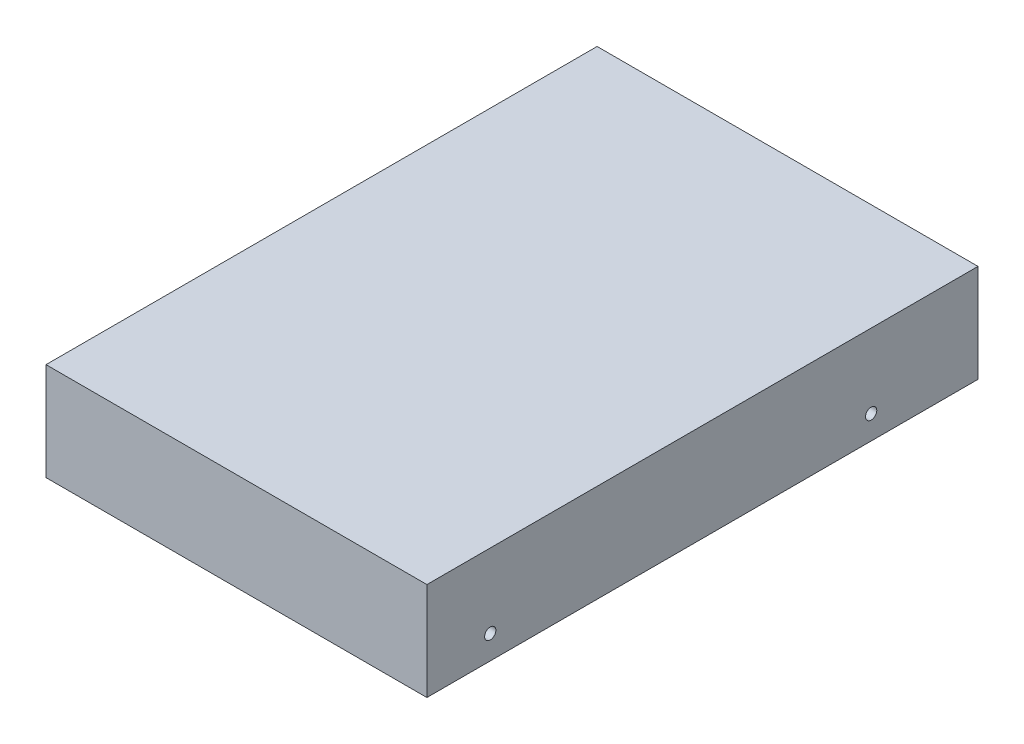
ISO-10303-21;
HEADER;
FILE_DESCRIPTION(('STEP AP214'),'2;1');
FILE_NAME('part.step','',(''),(''),'','','');
FILE_SCHEMA(('AUTOMOTIVE_DESIGN { 1 0 10303 214 1 1 1 1 }'));
ENDSEC;
DATA;
#1=APPLICATION_CONTEXT('core data for automotive mechanical design processes');
#2=APPLICATION_PROTOCOL_DEFINITION('international standard','automotive_design',2000,#1);
#3=PRODUCT_CONTEXT('',#1,'mechanical');
#4=PRODUCT('Part','Part','',(#3));
#5=PRODUCT_RELATED_PRODUCT_CATEGORY('part','',(#4));
#6=PRODUCT_DEFINITION_FORMATION('','',#4);
#7=PRODUCT_DEFINITION_CONTEXT('part definition',#1,'design');
#8=PRODUCT_DEFINITION('design','',#6,#7);
#9=PRODUCT_DEFINITION_SHAPE('','',#8);
#10=(LENGTH_UNIT() NAMED_UNIT(*) SI_UNIT(.MILLI.,.METRE.));
#11=(NAMED_UNIT(*) PLANE_ANGLE_UNIT() SI_UNIT($,.RADIAN.));
#12=(NAMED_UNIT(*) SI_UNIT($,.STERADIAN.) SOLID_ANGLE_UNIT());
#13=UNCERTAINTY_MEASURE_WITH_UNIT(LENGTH_MEASURE(1.E-05),#10,'distance_accuracy_value','');
#14=(GEOMETRIC_REPRESENTATION_CONTEXT(3) GLOBAL_UNCERTAINTY_ASSIGNED_CONTEXT((#13)) GLOBAL_UNIT_ASSIGNED_CONTEXT((#10,
#11,#12)) REPRESENTATION_CONTEXT('',''));
#15=CARTESIAN_POINT('',(0.,0.,0.));
#16=DIRECTION('',(0.,0.,1.));
#17=DIRECTION('',(1.,0.,0.));
#18=AXIS2_PLACEMENT_3D('',#15,#16,#17);
#19=CARTESIAN_POINT('',(0.,26.1,0.));
#20=DIRECTION('',(1.,0.,0.));
#21=DIRECTION('',(0.,0.,-1.));
#22=AXIS2_PLACEMENT_3D('',#19,#20,#21);
#23=PLANE('',#22);
#24=CARTESIAN_POINT('',(0.,6.35,-16.9));
#25=DIRECTION('',(1.,0.,0.));
#26=DIRECTION('',(0.,0.,-1.));
#27=AXIS2_PLACEMENT_3D('',#24,#25,#26);
#28=CIRCLE('',#27,1.7526);
#29=CARTESIAN_POINT('',(0.,6.35,-18.6526));
#30=VERTEX_POINT('',#29);
#31=EDGE_CURVE('E145',#30,#30,#28,.T.);
#32=ORIENTED_EDGE('',*,*,#31,.T.);
#33=EDGE_LOOP('',(#32));
#34=FACE_BOUND('',#33,.T.);
#35=CARTESIAN_POINT('',(0.,6.35,-118.5));
#36=DIRECTION('',(1.,0.,0.));
#37=DIRECTION('',(0.,0.,-1.));
#38=AXIS2_PLACEMENT_3D('',#35,#36,#37);
#39=CIRCLE('',#38,1.75259999999999);
#40=CARTESIAN_POINT('',(0.,6.35,-120.2526));
#41=VERTEX_POINT('',#40);
#42=EDGE_CURVE('E136',#41,#41,#39,.T.);
#43=ORIENTED_EDGE('',*,*,#42,.T.);
#44=EDGE_LOOP('',(#43));
#45=FACE_BOUND('',#44,.T.);
#46=DIRECTION('',(0.,0.,1.));
#47=VECTOR('',#46,1.);
#48=CARTESIAN_POINT('',(0.,0.,0.));
#49=LINE('',#48,#47);
#50=CARTESIAN_POINT('',(0.,0.,-147.));
#51=VERTEX_POINT('',#50);
#52=CARTESIAN_POINT('',(0.,0.,0.));
#53=VERTEX_POINT('',#52);
#54=EDGE_CURVE('E115',#51,#53,#49,.T.);
#55=ORIENTED_EDGE('',*,*,#54,.T.);
#56=DIRECTION('',(0.,-1.,0.));
#57=VECTOR('',#56,1.);
#58=CARTESIAN_POINT('',(0.,26.1,0.));
#59=LINE('',#58,#57);
#60=CARTESIAN_POINT('',(0.,26.1,0.));
#61=VERTEX_POINT('',#60);
#62=EDGE_CURVE('E11',#61,#53,#59,.T.);
#63=ORIENTED_EDGE('',*,*,#62,.F.);
#64=DIRECTION('',(0.,0.,1.));
#65=VECTOR('',#64,1.);
#66=CARTESIAN_POINT('',(0.,26.1,0.));
#67=LINE('',#66,#65);
#68=CARTESIAN_POINT('',(0.,26.1,-147.));
#69=VERTEX_POINT('',#68);
#70=EDGE_CURVE('E99',#69,#61,#67,.T.);
#71=ORIENTED_EDGE('',*,*,#70,.F.);
#72=DIRECTION('',(0.,-1.,0.));
#73=VECTOR('',#72,1.);
#74=CARTESIAN_POINT('',(0.,26.1,-147.));
#75=LINE('',#74,#73);
#76=EDGE_CURVE('E111',#69,#51,#75,.T.);
#77=ORIENTED_EDGE('',*,*,#76,.T.);
#78=EDGE_LOOP('',(#55,#63,#71,#77));
#79=FACE_BOUND('',#78,.T.);
#80=ADVANCED_FACE('F47',(#34,#45,#79),#23,.F.);
#81=CARTESIAN_POINT('',(0.,26.1,0.));
#82=DIRECTION('',(0.,0.,-1.));
#83=DIRECTION('',(-1.,0.,0.));
#84=AXIS2_PLACEMENT_3D('',#81,#82,#83);
#85=PLANE('',#84);
#86=DIRECTION('',(1.,0.,0.));
#87=VECTOR('',#86,1.);
#88=CARTESIAN_POINT('',(0.,0.,0.));
#89=LINE('',#88,#87);
#90=CARTESIAN_POINT('',(101.6,0.,0.));
#91=VERTEX_POINT('',#90);
#92=EDGE_CURVE('E104',#53,#91,#89,.T.);
#93=ORIENTED_EDGE('',*,*,#92,.T.);
#94=DIRECTION('',(0.,-1.,0.));
#95=VECTOR('',#94,1.);
#96=CARTESIAN_POINT('',(101.6,26.1,0.));
#97=LINE('',#96,#95);
#98=CARTESIAN_POINT('',(101.6,26.1,0.));
#99=VERTEX_POINT('',#98);
#100=EDGE_CURVE('E56',#99,#91,#97,.T.);
#101=ORIENTED_EDGE('',*,*,#100,.F.);
#102=DIRECTION('',(1.,0.,0.));
#103=VECTOR('',#102,1.);
#104=CARTESIAN_POINT('',(0.,26.1,0.));
#105=LINE('',#104,#103);
#106=EDGE_CURVE('E94',#61,#99,#105,.T.);
#107=ORIENTED_EDGE('',*,*,#106,.F.);
#108=ORIENTED_EDGE('',*,*,#62,.T.);
#109=EDGE_LOOP('',(#93,#101,#107,#108));
#110=FACE_BOUND('',#109,.T.);
#111=ADVANCED_FACE('F103',(#110),#85,.F.);
#112=CARTESIAN_POINT('',(101.6,26.1,0.));
#113=DIRECTION('',(-1.,0.,0.));
#114=DIRECTION('',(0.,0.,1.));
#115=AXIS2_PLACEMENT_3D('',#112,#113,#114);
#116=PLANE('',#115);
#117=CARTESIAN_POINT('',(101.6,6.35,-118.5));
#118=DIRECTION('',(1.,0.,0.));
#119=DIRECTION('',(0.,0.,-1.));
#120=AXIS2_PLACEMENT_3D('',#117,#118,#119);
#121=CIRCLE('',#120,1.5);
#122=CARTESIAN_POINT('',(101.6,6.35,-120.));
#123=VERTEX_POINT('',#122);
#124=EDGE_CURVE('E160',#123,#123,#121,.T.);
#125=ORIENTED_EDGE('',*,*,#124,.F.);
#126=EDGE_LOOP('',(#125));
#127=FACE_BOUND('',#126,.T.);
#128=CARTESIAN_POINT('',(101.6,6.35,-16.9));
#129=DIRECTION('',(1.,0.,0.));
#130=DIRECTION('',(0.,0.,-1.));
#131=AXIS2_PLACEMENT_3D('',#128,#129,#130);
#132=CIRCLE('',#131,1.5);
#133=CARTESIAN_POINT('',(101.6,6.35,-18.4));
#134=VERTEX_POINT('',#133);
#135=EDGE_CURVE('E156',#134,#134,#132,.T.);
#136=ORIENTED_EDGE('',*,*,#135,.F.);
#137=EDGE_LOOP('',(#136));
#138=FACE_BOUND('',#137,.T.);
#139=DIRECTION('',(0.,0.,-1.));
#140=VECTOR('',#139,1.);
#141=CARTESIAN_POINT('',(101.6,0.,0.));
#142=LINE('',#141,#140);
#143=CARTESIAN_POINT('',(101.6,0.,-147.));
#144=VERTEX_POINT('',#143);
#145=EDGE_CURVE('E81',#91,#144,#142,.T.);
#146=ORIENTED_EDGE('',*,*,#145,.T.);
#147=DIRECTION('',(0.,-1.,0.));
#148=VECTOR('',#147,1.);
#149=CARTESIAN_POINT('',(101.6,26.1,-147.));
#150=LINE('',#149,#148);
#151=CARTESIAN_POINT('',(101.6,26.1,-147.));
#152=VERTEX_POINT('',#151);
#153=EDGE_CURVE('E106',#152,#144,#150,.T.);
#154=ORIENTED_EDGE('',*,*,#153,.F.);
#155=DIRECTION('',(0.,0.,-1.));
#156=VECTOR('',#155,1.);
#157=CARTESIAN_POINT('',(101.6,26.1,0.));
#158=LINE('',#157,#156);
#159=EDGE_CURVE('E97',#99,#152,#158,.T.);
#160=ORIENTED_EDGE('',*,*,#159,.F.);
#161=ORIENTED_EDGE('',*,*,#100,.T.);
#162=EDGE_LOOP('',(#146,#154,#160,#161));
#163=FACE_BOUND('',#162,.T.);
#164=ADVANCED_FACE('F107',(#127,#138,#163),#116,.F.);
#165=CARTESIAN_POINT('',(0.,26.1,-147.));
#166=DIRECTION('',(0.,0.,1.));
#167=DIRECTION('',(1.,0.,0.));
#168=AXIS2_PLACEMENT_3D('',#165,#166,#167);
#169=PLANE('',#168);
#170=DIRECTION('',(-1.,0.,0.));
#171=VECTOR('',#170,1.);
#172=CARTESIAN_POINT('',(0.,0.,-147.));
#173=LINE('',#172,#171);
#174=EDGE_CURVE('E87',#144,#51,#173,.T.);
#175=ORIENTED_EDGE('',*,*,#174,.T.);
#176=ORIENTED_EDGE('',*,*,#76,.F.);
#177=DIRECTION('',(-1.,0.,0.));
#178=VECTOR('',#177,1.);
#179=CARTESIAN_POINT('',(0.,26.1,-147.));
#180=LINE('',#179,#178);
#181=EDGE_CURVE('E64',#152,#69,#180,.T.);
#182=ORIENTED_EDGE('',*,*,#181,.F.);
#183=ORIENTED_EDGE('',*,*,#153,.T.);
#184=EDGE_LOOP('',(#175,#176,#182,#183));
#185=FACE_BOUND('',#184,.T.);
#186=ADVANCED_FACE('F129',(#185),#169,.F.);
#187=CARTESIAN_POINT('',(0.,26.1,0.));
#188=DIRECTION('',(0.,-1.,0.));
#189=DIRECTION('',(0.,0.,-1.));
#190=AXIS2_PLACEMENT_3D('',#187,#188,#189);
#191=PLANE('',#190);
#192=ORIENTED_EDGE('',*,*,#70,.T.);
#193=ORIENTED_EDGE('',*,*,#106,.T.);
#194=ORIENTED_EDGE('',*,*,#159,.T.);
#195=ORIENTED_EDGE('',*,*,#181,.T.);
#196=EDGE_LOOP('',(#192,#193,#194,#195));
#197=FACE_BOUND('',#196,.T.);
#198=ADVANCED_FACE('F95',(#197),#191,.F.);
#199=CARTESIAN_POINT('',(0.,0.,0.));
#200=DIRECTION('',(0.,-1.,0.));
#201=DIRECTION('',(0.,0.,-1.));
#202=AXIS2_PLACEMENT_3D('',#199,#200,#201);
#203=PLANE('',#202);
#204=ORIENTED_EDGE('',*,*,#54,.F.);
#205=ORIENTED_EDGE('',*,*,#174,.F.);
#206=ORIENTED_EDGE('',*,*,#145,.F.);
#207=ORIENTED_EDGE('',*,*,#92,.F.);
#208=EDGE_LOOP('',(#204,#205,#206,#207));
#209=FACE_BOUND('',#208,.T.);
#210=ADVANCED_FACE('F132',(#209),#203,.T.);
#211=CARTESIAN_POINT('',(3.,6.35,-118.5));
#212=DIRECTION('',(-1.,0.,0.));
#213=DIRECTION('',(0.,0.,1.));
#214=AXIS2_PLACEMENT_3D('',#211,#212,#213);
#215=CYLINDRICAL_SURFACE('',#214,1.75259999999999);
#216=CARTESIAN_POINT('',(3.,6.35,-118.5));
#217=DIRECTION('',(1.,0.,0.));
#218=DIRECTION('',(0.,0.,-1.));
#219=AXIS2_PLACEMENT_3D('',#216,#217,#218);
#220=CIRCLE('',#219,1.75259999999999);
#221=CARTESIAN_POINT('',(3.,6.35,-120.2526));
#222=VERTEX_POINT('',#221);
#223=EDGE_CURVE('E140',#222,#222,#220,.T.);
#224=ORIENTED_EDGE('',*,*,#223,.T.);
#225=EDGE_LOOP('',(#224));
#226=FACE_BOUND('',#225,.T.);
#227=ORIENTED_EDGE('',*,*,#42,.F.);
#228=EDGE_LOOP('',(#227));
#229=FACE_BOUND('',#228,.T.);
#230=ADVANCED_FACE('F208',(#226,#229),#215,.F.);
#231=CARTESIAN_POINT('',(3.,6.35,-118.5));
#232=DIRECTION('',(1.,0.,0.));
#233=DIRECTION('',(0.,0.,-1.));
#234=AXIS2_PLACEMENT_3D('',#231,#232,#233);
#235=PLANE('',#234);
#236=ORIENTED_EDGE('',*,*,#223,.F.);
#237=EDGE_LOOP('',(#236));
#238=FACE_BOUND('',#237,.T.);
#239=ADVANCED_FACE('F209',(#238),#235,.F.);
#240=CARTESIAN_POINT('',(3.,6.35,-16.9));
#241=DIRECTION('',(-1.,0.,0.));
#242=DIRECTION('',(0.,0.,1.));
#243=AXIS2_PLACEMENT_3D('',#240,#241,#242);
#244=CYLINDRICAL_SURFACE('',#243,1.7526);
#245=CARTESIAN_POINT('',(3.,6.35,-16.9));
#246=DIRECTION('',(1.,0.,0.));
#247=DIRECTION('',(0.,0.,-1.));
#248=AXIS2_PLACEMENT_3D('',#245,#246,#247);
#249=CIRCLE('',#248,1.7526);
#250=CARTESIAN_POINT('',(3.,6.35,-18.6526));
#251=VERTEX_POINT('',#250);
#252=EDGE_CURVE('E119',#251,#251,#249,.T.);
#253=ORIENTED_EDGE('',*,*,#252,.T.);
#254=EDGE_LOOP('',(#253));
#255=FACE_BOUND('',#254,.T.);
#256=ORIENTED_EDGE('',*,*,#31,.F.);
#257=EDGE_LOOP('',(#256));
#258=FACE_BOUND('',#257,.T.);
#259=ADVANCED_FACE('F193',(#255,#258),#244,.F.);
#260=CARTESIAN_POINT('',(3.,6.35,-16.9));
#261=DIRECTION('',(1.,0.,0.));
#262=DIRECTION('',(0.,0.,-1.));
#263=AXIS2_PLACEMENT_3D('',#260,#261,#262);
#264=PLANE('',#263);
#265=ORIENTED_EDGE('',*,*,#252,.F.);
#266=EDGE_LOOP('',(#265));
#267=FACE_BOUND('',#266,.T.);
#268=ADVANCED_FACE('F184',(#267),#264,.F.);
#269=CARTESIAN_POINT('',(98.6,6.35,-16.9));
#270=DIRECTION('',(1.,0.,0.));
#271=DIRECTION('',(0.,0.,-1.));
#272=AXIS2_PLACEMENT_3D('',#269,#270,#271);
#273=CYLINDRICAL_SURFACE('',#272,1.5);
#274=CARTESIAN_POINT('',(98.6,6.35,-16.9));
#275=DIRECTION('',(1.,0.,0.));
#276=DIRECTION('',(0.,0.,-1.));
#277=AXIS2_PLACEMENT_3D('',#274,#275,#276);
#278=CIRCLE('',#277,1.5);
#279=CARTESIAN_POINT('',(98.6,6.35,-18.4));
#280=VERTEX_POINT('',#279);
#281=EDGE_CURVE('E152',#280,#280,#278,.T.);
#282=ORIENTED_EDGE('',*,*,#281,.F.);
#283=EDGE_LOOP('',(#282));
#284=FACE_BOUND('',#283,.T.);
#285=ORIENTED_EDGE('',*,*,#135,.T.);
#286=EDGE_LOOP('',(#285));
#287=FACE_BOUND('',#286,.T.);
#288=ADVANCED_FACE('F182',(#284,#287),#273,.F.);
#289=CARTESIAN_POINT('',(98.6,6.35,-16.9));
#290=DIRECTION('',(1.,0.,0.));
#291=DIRECTION('',(0.,0.,-1.));
#292=AXIS2_PLACEMENT_3D('',#289,#290,#291);
#293=PLANE('',#292);
#294=ORIENTED_EDGE('',*,*,#281,.T.);
#295=EDGE_LOOP('',(#294));
#296=FACE_BOUND('',#295,.T.);
#297=ADVANCED_FACE('F173',(#296),#293,.T.);
#298=CARTESIAN_POINT('',(98.6,6.35,-118.5));
#299=DIRECTION('',(1.,0.,0.));
#300=DIRECTION('',(0.,0.,-1.));
#301=AXIS2_PLACEMENT_3D('',#298,#299,#300);
#302=CYLINDRICAL_SURFACE('',#301,1.5);
#303=CARTESIAN_POINT('',(98.6,6.35,-118.5));
#304=DIRECTION('',(1.,0.,0.));
#305=DIRECTION('',(0.,0.,-1.));
#306=AXIS2_PLACEMENT_3D('',#303,#304,#305);
#307=CIRCLE('',#306,1.5);
#308=CARTESIAN_POINT('',(98.6,6.35,-120.));
#309=VERTEX_POINT('',#308);
#310=EDGE_CURVE('E141',#309,#309,#307,.T.);
#311=ORIENTED_EDGE('',*,*,#310,.F.);
#312=EDGE_LOOP('',(#311));
#313=FACE_BOUND('',#312,.T.);
#314=ORIENTED_EDGE('',*,*,#124,.T.);
#315=EDGE_LOOP('',(#314));
#316=FACE_BOUND('',#315,.T.);
#317=ADVANCED_FACE('F170',(#313,#316),#302,.F.);
#318=CARTESIAN_POINT('',(98.6,6.35,-118.5));
#319=DIRECTION('',(1.,0.,0.));
#320=DIRECTION('',(0.,0.,-1.));
#321=AXIS2_PLACEMENT_3D('',#318,#319,#320);
#322=PLANE('',#321);
#323=ORIENTED_EDGE('',*,*,#310,.T.);
#324=EDGE_LOOP('',(#323));
#325=FACE_BOUND('',#324,.T.);
#326=ADVANCED_FACE('F168',(#325),#322,.T.);
#327=CLOSED_SHELL('',(#80,#111,#164,#186,#198,#210,#230,#239,#259,#268,#288,#297,#317,#326));
#328=MANIFOLD_SOLID_BREP('B2',#327);
#329=ADVANCED_BREP_SHAPE_REPRESENTATION('',(#18,#328),#14);
#330=SHAPE_DEFINITION_REPRESENTATION(#9,#329);
ENDSEC;
END-ISO-10303-21;
